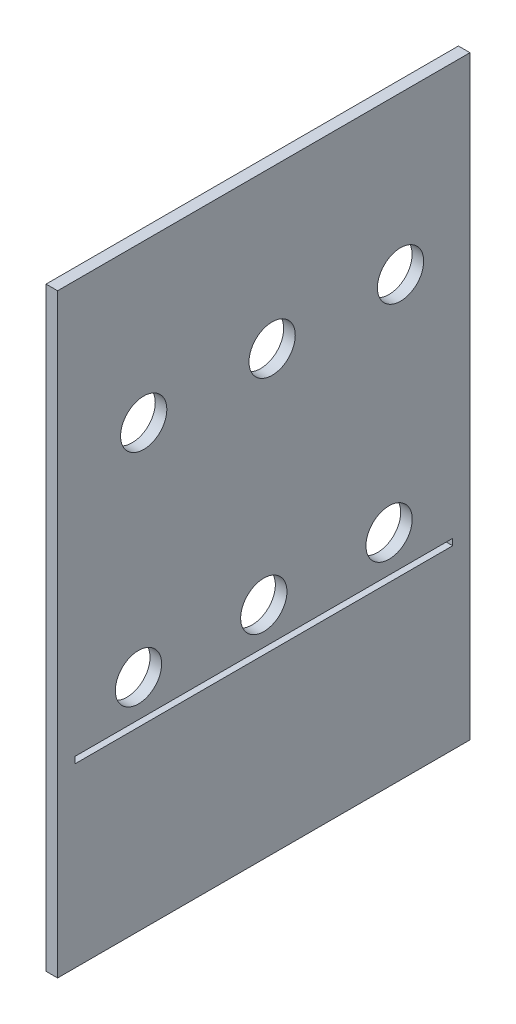
ISO-10303-21;
HEADER;
FILE_DESCRIPTION(('STEP AP214'),'2;1');
FILE_NAME('part.step','',(''),(''),'','','');
FILE_SCHEMA(('AUTOMOTIVE_DESIGN { 1 0 10303 214 1 1 1 1 }'));
ENDSEC;
DATA;
#1=APPLICATION_CONTEXT('core data for automotive mechanical design processes');
#2=APPLICATION_PROTOCOL_DEFINITION('international standard','automotive_design',2000,#1);
#3=PRODUCT_CONTEXT('',#1,'mechanical');
#4=PRODUCT('Part','Part','',(#3));
#5=PRODUCT_RELATED_PRODUCT_CATEGORY('part','',(#4));
#6=PRODUCT_DEFINITION_FORMATION('','',#4);
#7=PRODUCT_DEFINITION_CONTEXT('part definition',#1,'design');
#8=PRODUCT_DEFINITION('design','',#6,#7);
#9=PRODUCT_DEFINITION_SHAPE('','',#8);
#10=(LENGTH_UNIT() NAMED_UNIT(*) SI_UNIT(.MILLI.,.METRE.));
#11=(NAMED_UNIT(*) PLANE_ANGLE_UNIT() SI_UNIT($,.RADIAN.));
#12=(NAMED_UNIT(*) SI_UNIT($,.STERADIAN.) SOLID_ANGLE_UNIT());
#13=UNCERTAINTY_MEASURE_WITH_UNIT(LENGTH_MEASURE(1.E-05),#10,'distance_accuracy_value','');
#14=(GEOMETRIC_REPRESENTATION_CONTEXT(3) GLOBAL_UNCERTAINTY_ASSIGNED_CONTEXT((#13)) GLOBAL_UNIT_ASSIGNED_CONTEXT((#10,
#11,#12)) REPRESENTATION_CONTEXT('',''));
#15=CARTESIAN_POINT('',(0.,0.,0.));
#16=DIRECTION('',(0.,0.,1.));
#17=DIRECTION('',(1.,0.,0.));
#18=AXIS2_PLACEMENT_3D('',#15,#16,#17);
#19=CARTESIAN_POINT('',(0.,123.952,-185.1025));
#20=DIRECTION('',(-1.,0.,0.));
#21=DIRECTION('',(0.,0.,1.));
#22=AXIS2_PLACEMENT_3D('',#19,#20,#21);
#23=CYLINDRICAL_SURFACE('',#22,12.7);
#24=CARTESIAN_POINT('',(-3.175,123.952,-185.1025));
#25=DIRECTION('',(-1.,0.,0.));
#26=DIRECTION('',(0.,0.,1.));
#27=AXIS2_PLACEMENT_3D('',#24,#25,#26);
#28=CIRCLE('',#27,12.7);
#29=CARTESIAN_POINT('',(-3.175,123.952,-172.4025));
#30=VERTEX_POINT('',#29);
#31=EDGE_CURVE('E40',#30,#30,#28,.T.);
#32=ORIENTED_EDGE('',*,*,#31,.T.);
#33=EDGE_LOOP('',(#32));
#34=FACE_BOUND('',#33,.T.);
#35=CARTESIAN_POINT('',(3.17499999999999,123.952,-185.1025));
#36=DIRECTION('',(1.,0.,0.));
#37=DIRECTION('',(0.,0.,-1.));
#38=AXIS2_PLACEMENT_3D('',#35,#36,#37);
#39=CIRCLE('',#38,12.7);
#40=CARTESIAN_POINT('',(3.17499999999999,123.952,-197.8025));
#41=VERTEX_POINT('',#40);
#42=EDGE_CURVE('E167',#41,#41,#39,.T.);
#43=ORIENTED_EDGE('',*,*,#42,.T.);
#44=EDGE_LOOP('',(#43));
#45=FACE_BOUND('',#44,.T.);
#46=ADVANCED_FACE('F32',(#34,#45),#23,.F.);
#47=CARTESIAN_POINT('',(0.,123.952,-116.332));
#48=DIRECTION('',(-1.,0.,0.));
#49=DIRECTION('',(0.,0.,1.));
#50=AXIS2_PLACEMENT_3D('',#47,#48,#49);
#51=CYLINDRICAL_SURFACE('',#50,12.7);
#52=CARTESIAN_POINT('',(-3.175,123.952,-116.332));
#53=DIRECTION('',(-1.,0.,0.));
#54=DIRECTION('',(0.,0.,1.));
#55=AXIS2_PLACEMENT_3D('',#52,#53,#54);
#56=CIRCLE('',#55,12.7);
#57=CARTESIAN_POINT('',(-3.175,123.952,-103.632));
#58=VERTEX_POINT('',#57);
#59=EDGE_CURVE('E191',#58,#58,#56,.T.);
#60=ORIENTED_EDGE('',*,*,#59,.T.);
#61=EDGE_LOOP('',(#60));
#62=FACE_BOUND('',#61,.T.);
#63=CARTESIAN_POINT('',(3.17499999999999,123.952,-116.332));
#64=DIRECTION('',(1.,0.,0.));
#65=DIRECTION('',(0.,0.,-1.));
#66=AXIS2_PLACEMENT_3D('',#63,#64,#65);
#67=CIRCLE('',#66,12.7);
#68=CARTESIAN_POINT('',(3.17499999999999,123.952,-129.032));
#69=VERTEX_POINT('',#68);
#70=EDGE_CURVE('E170',#69,#69,#67,.T.);
#71=ORIENTED_EDGE('',*,*,#70,.T.);
#72=EDGE_LOOP('',(#71));
#73=FACE_BOUND('',#72,.T.);
#74=ADVANCED_FACE('F211',(#62,#73),#51,.F.);
#75=CARTESIAN_POINT('',(0.,123.952,-47.5615));
#76=DIRECTION('',(-1.,0.,0.));
#77=DIRECTION('',(0.,0.,1.));
#78=AXIS2_PLACEMENT_3D('',#75,#76,#77);
#79=CYLINDRICAL_SURFACE('',#78,12.7);
#80=CARTESIAN_POINT('',(-3.175,123.952,-47.5615));
#81=DIRECTION('',(-1.,0.,0.));
#82=DIRECTION('',(0.,0.,1.));
#83=AXIS2_PLACEMENT_3D('',#80,#81,#82);
#84=CIRCLE('',#83,12.7);
#85=CARTESIAN_POINT('',(-3.175,123.952,-34.8615));
#86=VERTEX_POINT('',#85);
#87=EDGE_CURVE('E188',#86,#86,#84,.T.);
#88=ORIENTED_EDGE('',*,*,#87,.T.);
#89=EDGE_LOOP('',(#88));
#90=FACE_BOUND('',#89,.T.);
#91=CARTESIAN_POINT('',(3.17499999999998,123.952,-47.5615));
#92=DIRECTION('',(1.,0.,0.));
#93=DIRECTION('',(0.,0.,-1.));
#94=AXIS2_PLACEMENT_3D('',#91,#92,#93);
#95=CIRCLE('',#94,12.7);
#96=CARTESIAN_POINT('',(3.17499999999998,123.952,-60.2615));
#97=VERTEX_POINT('',#96);
#98=EDGE_CURVE('E173',#97,#97,#95,.T.);
#99=ORIENTED_EDGE('',*,*,#98,.T.);
#100=EDGE_LOOP('',(#99));
#101=FACE_BOUND('',#100,.T.);
#102=ADVANCED_FACE('F215',(#90,#101),#79,.F.);
#103=CARTESIAN_POINT('',(-260.351,243.459,-191.389));
#104=DIRECTION('',(1.,0.,0.));
#105=DIRECTION('',(0.,0.,-1.));
#106=AXIS2_PLACEMENT_3D('',#103,#104,#105);
#107=CYLINDRICAL_SURFACE('',#106,12.7);
#108=CARTESIAN_POINT('',(-3.17499999999998,243.459,-191.389));
#109=DIRECTION('',(-1.,0.,0.));
#110=DIRECTION('',(0.,0.,1.));
#111=AXIS2_PLACEMENT_3D('',#108,#109,#110);
#112=CIRCLE('',#111,12.7);
#113=CARTESIAN_POINT('',(-3.17499999999998,243.459,-178.689));
#114=VERTEX_POINT('',#113);
#115=EDGE_CURVE('E185',#114,#114,#112,.F.);
#116=ORIENTED_EDGE('',*,*,#115,.F.);
#117=EDGE_LOOP('',(#116));
#118=FACE_BOUND('',#117,.T.);
#119=CARTESIAN_POINT('',(3.17499999999999,243.459,-191.389));
#120=DIRECTION('',(1.,0.,0.));
#121=DIRECTION('',(0.,0.,-1.));
#122=AXIS2_PLACEMENT_3D('',#119,#120,#121);
#123=CIRCLE('',#122,12.7);
#124=CARTESIAN_POINT('',(3.175,243.459,-204.089));
#125=VERTEX_POINT('',#124);
#126=EDGE_CURVE('E158',#125,#125,#123,.T.);
#127=ORIENTED_EDGE('',*,*,#126,.T.);
#128=EDGE_LOOP('',(#127));
#129=FACE_BOUND('',#128,.T.);
#130=ADVANCED_FACE('F221',(#118,#129),#107,.F.);
#131=CARTESIAN_POINT('',(-260.351,243.459,-120.904));
#132=DIRECTION('',(1.,0.,0.));
#133=DIRECTION('',(0.,0.,-1.));
#134=AXIS2_PLACEMENT_3D('',#131,#132,#133);
#135=CYLINDRICAL_SURFACE('',#134,12.7);
#136=CARTESIAN_POINT('',(-3.17499999999998,243.459,-120.904));
#137=DIRECTION('',(-1.,0.,0.));
#138=DIRECTION('',(0.,0.,1.));
#139=AXIS2_PLACEMENT_3D('',#136,#137,#138);
#140=CIRCLE('',#139,12.7);
#141=CARTESIAN_POINT('',(-3.17499999999998,243.459,-108.204));
#142=VERTEX_POINT('',#141);
#143=EDGE_CURVE('E182',#142,#142,#140,.F.);
#144=ORIENTED_EDGE('',*,*,#143,.F.);
#145=EDGE_LOOP('',(#144));
#146=FACE_BOUND('',#145,.T.);
#147=CARTESIAN_POINT('',(3.17499999999999,243.459,-120.904));
#148=DIRECTION('',(1.,0.,0.));
#149=DIRECTION('',(0.,0.,-1.));
#150=AXIS2_PLACEMENT_3D('',#147,#148,#149);
#151=CIRCLE('',#150,12.7);
#152=CARTESIAN_POINT('',(3.17499999999999,243.459,-133.604));
#153=VERTEX_POINT('',#152);
#154=EDGE_CURVE('E161',#153,#153,#151,.T.);
#155=ORIENTED_EDGE('',*,*,#154,.T.);
#156=EDGE_LOOP('',(#155));
#157=FACE_BOUND('',#156,.T.);
#158=ADVANCED_FACE('F225',(#146,#157),#135,.F.);
#159=CARTESIAN_POINT('',(-260.351,243.459,-50.419));
#160=DIRECTION('',(1.,0.,0.));
#161=DIRECTION('',(0.,0.,-1.));
#162=AXIS2_PLACEMENT_3D('',#159,#160,#161);
#163=CYLINDRICAL_SURFACE('',#162,12.7);
#164=CARTESIAN_POINT('',(-3.17499999999998,243.459,-50.419));
#165=DIRECTION('',(-1.,0.,0.));
#166=DIRECTION('',(0.,0.,1.));
#167=AXIS2_PLACEMENT_3D('',#164,#165,#166);
#168=CIRCLE('',#167,12.7);
#169=CARTESIAN_POINT('',(-3.17499999999998,243.459,-37.719));
#170=VERTEX_POINT('',#169);
#171=EDGE_CURVE('E179',#170,#170,#168,.F.);
#172=ORIENTED_EDGE('',*,*,#171,.F.);
#173=EDGE_LOOP('',(#172));
#174=FACE_BOUND('',#173,.T.);
#175=CARTESIAN_POINT('',(3.17499999999998,243.459,-50.419));
#176=DIRECTION('',(1.,0.,0.));
#177=DIRECTION('',(0.,0.,-1.));
#178=AXIS2_PLACEMENT_3D('',#175,#176,#177);
#179=CIRCLE('',#178,12.7);
#180=CARTESIAN_POINT('',(3.17499999999998,243.459,-63.119));
#181=VERTEX_POINT('',#180);
#182=EDGE_CURVE('E164',#181,#181,#179,.T.);
#183=ORIENTED_EDGE('',*,*,#182,.T.);
#184=EDGE_LOOP('',(#183));
#185=FACE_BOUND('',#184,.T.);
#186=ADVANCED_FACE('F206',(#174,#185),#163,.F.);
#187=CARTESIAN_POINT('',(3.175,329.819,-235.839));
#188=DIRECTION('',(1.,0.,0.));
#189=DIRECTION('',(0.,0.,-1.));
#190=AXIS2_PLACEMENT_3D('',#187,#188,#189);
#191=PLANE('',#190);
#192=DIRECTION('',(0.,1.,0.));
#193=VECTOR('',#192,1.);
#194=CARTESIAN_POINT('',(3.175,103.733618270021,-220.005469387755));
#195=LINE('',#194,#193);
#196=CARTESIAN_POINT('',(3.175,100.205840492243,-220.005469387755));
#197=VERTEX_POINT('',#196);
#198=CARTESIAN_POINT('',(3.175,103.733618270021,-220.005469387755));
#199=VERTEX_POINT('',#198);
#200=EDGE_CURVE('E47',#197,#199,#195,.T.);
#201=ORIENTED_EDGE('',*,*,#200,.F.);
#202=DIRECTION('',(0.,0.,-1.));
#203=VECTOR('',#202,1.);
#204=CARTESIAN_POINT('',(3.17499999999997,100.205840492243,-12.6585306122449));
#205=LINE('',#204,#203);
#206=CARTESIAN_POINT('',(3.17499999999997,100.205840492243,-12.6585306122449));
#207=VERTEX_POINT('',#206);
#208=EDGE_CURVE('E115',#207,#197,#205,.T.);
#209=ORIENTED_EDGE('',*,*,#208,.F.);
#210=DIRECTION('',(0.,-1.,0.));
#211=VECTOR('',#210,1.);
#212=CARTESIAN_POINT('',(3.17499999999997,103.733618270021,-12.6585306122449));
#213=LINE('',#212,#211);
#214=CARTESIAN_POINT('',(3.17499999999997,103.733618270021,-12.6585306122449));
#215=VERTEX_POINT('',#214);
#216=EDGE_CURVE('E118',#215,#207,#213,.T.);
#217=ORIENTED_EDGE('',*,*,#216,.F.);
#218=DIRECTION('',(0.,0.,1.));
#219=VECTOR('',#218,1.);
#220=CARTESIAN_POINT('',(3.17499999999997,103.733618270021,-12.6585306122449));
#221=LINE('',#220,#219);
#222=EDGE_CURVE('E124',#199,#215,#221,.T.);
#223=ORIENTED_EDGE('',*,*,#222,.F.);
#224=EDGE_LOOP('',(#201,#209,#217,#223));
#225=FACE_BOUND('',#224,.T.);
#226=DIRECTION('',(0.,0.,-1.));
#227=VECTOR('',#226,1.);
#228=CARTESIAN_POINT('',(3.175,3.175,-229.489));
#229=LINE('',#228,#227);
#230=CARTESIAN_POINT('',(3.175,3.17500000000004,-3.17499999999998));
#231=VERTEX_POINT('',#230);
#232=CARTESIAN_POINT('',(3.175,3.175,-229.489));
#233=VERTEX_POINT('',#232);
#234=EDGE_CURVE('E134',#231,#233,#229,.T.);
#235=ORIENTED_EDGE('',*,*,#234,.T.);
#236=DIRECTION('',(0.,1.,0.));
#237=VECTOR('',#236,1.);
#238=CARTESIAN_POINT('',(3.175,329.819,-229.489));
#239=LINE('',#238,#237);
#240=CARTESIAN_POINT('',(3.175,329.819,-229.489));
#241=VERTEX_POINT('',#240);
#242=EDGE_CURVE('E152',#233,#241,#239,.T.);
#243=ORIENTED_EDGE('',*,*,#242,.T.);
#244=DIRECTION('',(0.,0.,1.));
#245=VECTOR('',#244,1.);
#246=CARTESIAN_POINT('',(3.175,329.819,-235.839));
#247=LINE('',#246,#245);
#248=CARTESIAN_POINT('',(3.17499999999997,329.819,-3.17500000000007));
#249=VERTEX_POINT('',#248);
#250=EDGE_CURVE('E176',#241,#249,#247,.T.);
#251=ORIENTED_EDGE('',*,*,#250,.T.);
#252=DIRECTION('',(0.,-1.,0.));
#253=VECTOR('',#252,1.);
#254=CARTESIAN_POINT('',(3.175,329.819,-3.175));
#255=LINE('',#254,#253);
#256=EDGE_CURVE('E144',#249,#231,#255,.T.);
#257=ORIENTED_EDGE('',*,*,#256,.T.);
#258=EDGE_LOOP('',(#235,#243,#251,#257));
#259=FACE_BOUND('',#258,.T.);
#260=ORIENTED_EDGE('',*,*,#126,.F.);
#261=EDGE_LOOP('',(#260));
#262=FACE_BOUND('',#261,.T.);
#263=ORIENTED_EDGE('',*,*,#154,.F.);
#264=EDGE_LOOP('',(#263));
#265=FACE_BOUND('',#264,.T.);
#266=ORIENTED_EDGE('',*,*,#182,.F.);
#267=EDGE_LOOP('',(#266));
#268=FACE_BOUND('',#267,.T.);
#269=ORIENTED_EDGE('',*,*,#42,.F.);
#270=EDGE_LOOP('',(#269));
#271=FACE_BOUND('',#270,.T.);
#272=ORIENTED_EDGE('',*,*,#70,.F.);
#273=EDGE_LOOP('',(#272));
#274=FACE_BOUND('',#273,.T.);
#275=ORIENTED_EDGE('',*,*,#98,.F.);
#276=EDGE_LOOP('',(#275));
#277=FACE_BOUND('',#276,.T.);
#278=ADVANCED_FACE('F199',(#225,#259,#262,#265,#268,#271,#274,#277),#191,.T.);
#279=CARTESIAN_POINT('',(-3.175,329.819,0.));
#280=DIRECTION('',(-1.,0.,0.));
#281=DIRECTION('',(0.,0.,1.));
#282=AXIS2_PLACEMENT_3D('',#279,#280,#281);
#283=PLANE('',#282);
#284=DIRECTION('',(0.,1.,0.));
#285=VECTOR('',#284,1.);
#286=CARTESIAN_POINT('',(-3.175,103.733618270021,-220.005469387755));
#287=LINE('',#286,#285);
#288=CARTESIAN_POINT('',(-3.175,100.205840492243,-220.005469387755));
#289=VERTEX_POINT('',#288);
#290=CARTESIAN_POINT('',(-3.175,103.733618270021,-220.005469387755));
#291=VERTEX_POINT('',#290);
#292=EDGE_CURVE('E99',#289,#291,#287,.T.);
#293=ORIENTED_EDGE('',*,*,#292,.T.);
#294=DIRECTION('',(0.,0.,1.));
#295=VECTOR('',#294,1.);
#296=CARTESIAN_POINT('',(-3.17500000000003,103.733618270021,-12.6585306122449));
#297=LINE('',#296,#295);
#298=CARTESIAN_POINT('',(-3.175,103.733618270021,-12.6585306122449));
#299=VERTEX_POINT('',#298);
#300=EDGE_CURVE('E108',#291,#299,#297,.T.);
#301=ORIENTED_EDGE('',*,*,#300,.T.);
#302=DIRECTION('',(0.,-1.,0.));
#303=VECTOR('',#302,1.);
#304=CARTESIAN_POINT('',(-3.17500000000003,103.733618270021,-12.6585306122449));
#305=LINE('',#304,#303);
#306=CARTESIAN_POINT('',(-3.17500000000003,100.205840492243,-12.6585306122449));
#307=VERTEX_POINT('',#306);
#308=EDGE_CURVE('E55',#299,#307,#305,.T.);
#309=ORIENTED_EDGE('',*,*,#308,.T.);
#310=DIRECTION('',(0.,0.,-1.));
#311=VECTOR('',#310,1.);
#312=CARTESIAN_POINT('',(-3.17500000000003,100.205840492243,-12.6585306122449));
#313=LINE('',#312,#311);
#314=EDGE_CURVE('E105',#307,#289,#313,.T.);
#315=ORIENTED_EDGE('',*,*,#314,.T.);
#316=EDGE_LOOP('',(#293,#301,#309,#315));
#317=FACE_BOUND('',#316,.T.);
#318=DIRECTION('',(0.,0.,-1.));
#319=VECTOR('',#318,1.);
#320=CARTESIAN_POINT('',(-3.175,3.175,-229.489));
#321=LINE('',#320,#319);
#322=CARTESIAN_POINT('',(-3.175,3.17499999999998,-3.175));
#323=VERTEX_POINT('',#322);
#324=CARTESIAN_POINT('',(-3.175,3.175,-229.489));
#325=VERTEX_POINT('',#324);
#326=EDGE_CURVE('E130',#323,#325,#321,.T.);
#327=ORIENTED_EDGE('',*,*,#326,.F.);
#328=DIRECTION('',(0.,-1.,0.));
#329=VECTOR('',#328,1.);
#330=CARTESIAN_POINT('',(-3.175,329.819,-3.175));
#331=LINE('',#330,#329);
#332=CARTESIAN_POINT('',(-3.175,329.819,-3.175));
#333=VERTEX_POINT('',#332);
#334=EDGE_CURVE('E142',#333,#323,#331,.T.);
#335=ORIENTED_EDGE('',*,*,#334,.F.);
#336=DIRECTION('',(0.,0.,-1.));
#337=VECTOR('',#336,1.);
#338=CARTESIAN_POINT('',(-3.175,329.819,0.));
#339=LINE('',#338,#337);
#340=CARTESIAN_POINT('',(-3.175,329.819,-229.489));
#341=VERTEX_POINT('',#340);
#342=EDGE_CURVE('E11',#333,#341,#339,.T.);
#343=ORIENTED_EDGE('',*,*,#342,.T.);
#344=DIRECTION('',(0.,1.,0.));
#345=VECTOR('',#344,1.);
#346=CARTESIAN_POINT('',(-3.175,329.819,-229.489));
#347=LINE('',#346,#345);
#348=EDGE_CURVE('E151',#325,#341,#347,.T.);
#349=ORIENTED_EDGE('',*,*,#348,.F.);
#350=EDGE_LOOP('',(#327,#335,#343,#349));
#351=FACE_BOUND('',#350,.T.);
#352=ORIENTED_EDGE('',*,*,#171,.T.);
#353=EDGE_LOOP('',(#352));
#354=FACE_BOUND('',#353,.T.);
#355=ORIENTED_EDGE('',*,*,#143,.T.);
#356=EDGE_LOOP('',(#355));
#357=FACE_BOUND('',#356,.T.);
#358=ORIENTED_EDGE('',*,*,#115,.T.);
#359=EDGE_LOOP('',(#358));
#360=FACE_BOUND('',#359,.T.);
#361=ORIENTED_EDGE('',*,*,#87,.F.);
#362=EDGE_LOOP('',(#361));
#363=FACE_BOUND('',#362,.T.);
#364=ORIENTED_EDGE('',*,*,#59,.F.);
#365=EDGE_LOOP('',(#364));
#366=FACE_BOUND('',#365,.T.);
#367=ORIENTED_EDGE('',*,*,#31,.F.);
#368=EDGE_LOOP('',(#367));
#369=FACE_BOUND('',#368,.T.);
#370=ADVANCED_FACE('F112',(#317,#351,#354,#357,#360,#363,#366,#369),#283,.T.);
#371=CARTESIAN_POINT('',(0.,329.819,0.));
#372=DIRECTION('',(0.,1.,0.));
#373=DIRECTION('',(0.,0.,1.));
#374=AXIS2_PLACEMENT_3D('',#371,#372,#373);
#375=PLANE('',#374);
#376=DIRECTION('',(-1.,0.,0.));
#377=VECTOR('',#376,1.);
#378=CARTESIAN_POINT('',(3.175,329.819,-3.175));
#379=LINE('',#378,#377);
#380=EDGE_CURVE('E147',#249,#333,#379,.T.);
#381=ORIENTED_EDGE('',*,*,#380,.F.);
#382=ORIENTED_EDGE('',*,*,#250,.F.);
#383=DIRECTION('',(-1.,0.,0.));
#384=VECTOR('',#383,1.);
#385=CARTESIAN_POINT('',(3.175,329.819,-229.489));
#386=LINE('',#385,#384);
#387=EDGE_CURVE('E154',#241,#341,#386,.T.);
#388=ORIENTED_EDGE('',*,*,#387,.T.);
#389=ORIENTED_EDGE('',*,*,#342,.F.);
#390=EDGE_LOOP('',(#381,#382,#388,#389));
#391=FACE_BOUND('',#390,.T.);
#392=ADVANCED_FACE('F34',(#391),#375,.T.);
#393=CARTESIAN_POINT('',(3.175,329.819,-229.489));
#394=DIRECTION('',(0.,0.,1.));
#395=DIRECTION('',(0.,-1.,0.));
#396=AXIS2_PLACEMENT_3D('',#393,#394,#395);
#397=PLANE('',#396);
#398=ORIENTED_EDGE('',*,*,#242,.F.);
#399=DIRECTION('',(-1.,0.,0.));
#400=VECTOR('',#399,1.);
#401=CARTESIAN_POINT('',(3.175,3.175,-229.489));
#402=LINE('',#401,#400);
#403=EDGE_CURVE('E139',#233,#325,#402,.T.);
#404=ORIENTED_EDGE('',*,*,#403,.T.);
#405=ORIENTED_EDGE('',*,*,#348,.T.);
#406=ORIENTED_EDGE('',*,*,#387,.F.);
#407=EDGE_LOOP('',(#398,#404,#405,#406));
#408=FACE_BOUND('',#407,.T.);
#409=ADVANCED_FACE('F204',(#408),#397,.F.);
#410=CARTESIAN_POINT('',(3.175,329.819,-3.175));
#411=DIRECTION('',(0.,0.,-1.));
#412=DIRECTION('',(0.,1.,0.));
#413=AXIS2_PLACEMENT_3D('',#410,#411,#412);
#414=PLANE('',#413);
#415=ORIENTED_EDGE('',*,*,#334,.T.);
#416=DIRECTION('',(-1.,0.,0.));
#417=VECTOR('',#416,1.);
#418=CARTESIAN_POINT('',(3.175,3.17499999999998,-3.175));
#419=LINE('',#418,#417);
#420=EDGE_CURVE('E137',#231,#323,#419,.T.);
#421=ORIENTED_EDGE('',*,*,#420,.F.);
#422=ORIENTED_EDGE('',*,*,#256,.F.);
#423=ORIENTED_EDGE('',*,*,#380,.T.);
#424=EDGE_LOOP('',(#415,#421,#422,#423));
#425=FACE_BOUND('',#424,.T.);
#426=ADVANCED_FACE('F235',(#425),#414,.F.);
#427=CARTESIAN_POINT('',(3.175,3.175,-229.489));
#428=DIRECTION('',(0.,1.,0.));
#429=DIRECTION('',(0.,0.,1.));
#430=AXIS2_PLACEMENT_3D('',#427,#428,#429);
#431=PLANE('',#430);
#432=ORIENTED_EDGE('',*,*,#326,.T.);
#433=ORIENTED_EDGE('',*,*,#403,.F.);
#434=ORIENTED_EDGE('',*,*,#234,.F.);
#435=ORIENTED_EDGE('',*,*,#420,.T.);
#436=EDGE_LOOP('',(#432,#433,#434,#435));
#437=FACE_BOUND('',#436,.T.);
#438=ADVANCED_FACE('F239',(#437),#431,.F.);
#439=CARTESIAN_POINT('',(-3.175,103.733618270021,-220.005469387755));
#440=DIRECTION('',(0.,0.,-1.));
#441=DIRECTION('',(-1.,0.,0.));
#442=AXIS2_PLACEMENT_3D('',#439,#440,#441);
#443=PLANE('',#442);
#444=ORIENTED_EDGE('',*,*,#200,.T.);
#445=DIRECTION('',(1.,0.,0.));
#446=VECTOR('',#445,1.);
#447=CARTESIAN_POINT('',(-3.175,103.733618270021,-220.005469387755));
#448=LINE('',#447,#446);
#449=EDGE_CURVE('E95',#291,#199,#448,.T.);
#450=ORIENTED_EDGE('',*,*,#449,.F.);
#451=ORIENTED_EDGE('',*,*,#292,.F.);
#452=DIRECTION('',(1.,0.,0.));
#453=VECTOR('',#452,1.);
#454=CARTESIAN_POINT('',(-3.175,100.205840492243,-220.005469387755));
#455=LINE('',#454,#453);
#456=EDGE_CURVE('E128',#289,#197,#455,.T.);
#457=ORIENTED_EDGE('',*,*,#456,.T.);
#458=EDGE_LOOP('',(#444,#450,#451,#457));
#459=FACE_BOUND('',#458,.T.);
#460=ADVANCED_FACE('F97',(#459),#443,.F.);
#461=CARTESIAN_POINT('',(-3.17500000000003,100.205840492243,-12.6585306122449));
#462=DIRECTION('',(0.,-1.,0.));
#463=DIRECTION('',(0.,0.,-1.));
#464=AXIS2_PLACEMENT_3D('',#461,#462,#463);
#465=PLANE('',#464);
#466=ORIENTED_EDGE('',*,*,#208,.T.);
#467=ORIENTED_EDGE('',*,*,#456,.F.);
#468=ORIENTED_EDGE('',*,*,#314,.F.);
#469=DIRECTION('',(1.,0.,0.));
#470=VECTOR('',#469,1.);
#471=CARTESIAN_POINT('',(-3.17500000000003,100.205840492243,-12.6585306122449));
#472=LINE('',#471,#470);
#473=EDGE_CURVE('E131',#307,#207,#472,.T.);
#474=ORIENTED_EDGE('',*,*,#473,.T.);
#475=EDGE_LOOP('',(#466,#467,#468,#474));
#476=FACE_BOUND('',#475,.T.);
#477=ADVANCED_FACE('F246',(#476),#465,.F.);
#478=CARTESIAN_POINT('',(-3.17500000000003,103.733618270021,-12.6585306122449));
#479=DIRECTION('',(0.,0.,1.));
#480=DIRECTION('',(0.,-1.,0.));
#481=AXIS2_PLACEMENT_3D('',#478,#479,#480);
#482=PLANE('',#481);
#483=ORIENTED_EDGE('',*,*,#216,.T.);
#484=ORIENTED_EDGE('',*,*,#473,.F.);
#485=ORIENTED_EDGE('',*,*,#308,.F.);
#486=DIRECTION('',(1.,0.,0.));
#487=VECTOR('',#486,1.);
#488=CARTESIAN_POINT('',(-3.17500000000003,103.733618270021,-12.6585306122449));
#489=LINE('',#488,#487);
#490=EDGE_CURVE('E104',#299,#215,#489,.T.);
#491=ORIENTED_EDGE('',*,*,#490,.T.);
#492=EDGE_LOOP('',(#483,#484,#485,#491));
#493=FACE_BOUND('',#492,.T.);
#494=ADVANCED_FACE('F249',(#493),#482,.F.);
#495=CARTESIAN_POINT('',(-3.17500000000003,103.733618270021,-12.6585306122449));
#496=DIRECTION('',(0.,1.,0.));
#497=DIRECTION('',(0.,0.,1.));
#498=AXIS2_PLACEMENT_3D('',#495,#496,#497);
#499=PLANE('',#498);
#500=ORIENTED_EDGE('',*,*,#222,.T.);
#501=ORIENTED_EDGE('',*,*,#490,.F.);
#502=ORIENTED_EDGE('',*,*,#300,.F.);
#503=ORIENTED_EDGE('',*,*,#449,.T.);
#504=EDGE_LOOP('',(#500,#501,#502,#503));
#505=FACE_BOUND('',#504,.T.);
#506=ADVANCED_FACE('F109',(#505),#499,.F.);
#507=CLOSED_SHELL('',(#46,#74,#102,#130,#158,#186,#278,#370,#392,#409,#426,#438,#460,#477,#494,#506));
#508=MANIFOLD_SOLID_BREP('B2',#507);
#509=ADVANCED_BREP_SHAPE_REPRESENTATION('',(#18,#508),#14);
#510=SHAPE_DEFINITION_REPRESENTATION(#9,#509);
ENDSEC;
END-ISO-10303-21;
